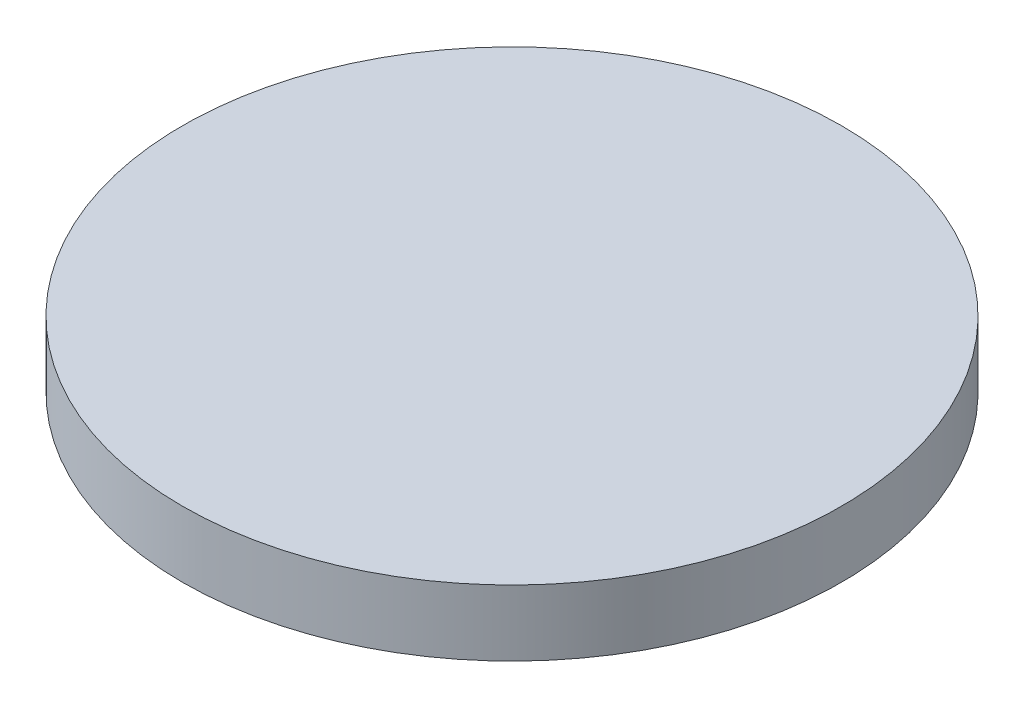
ISO-10303-21;
HEADER;
FILE_DESCRIPTION(('STEP AP214'),'2;1');
FILE_NAME('part.step','',(''),(''),'','','');
FILE_SCHEMA(('AUTOMOTIVE_DESIGN { 1 0 10303 214 1 1 1 1 }'));
ENDSEC;
DATA;
#1=APPLICATION_CONTEXT('core data for automotive mechanical design processes');
#2=APPLICATION_PROTOCOL_DEFINITION('international standard','automotive_design',2000,#1);
#3=PRODUCT_CONTEXT('',#1,'mechanical');
#4=PRODUCT('Part','Part','',(#3));
#5=PRODUCT_RELATED_PRODUCT_CATEGORY('part','',(#4));
#6=PRODUCT_DEFINITION_FORMATION('','',#4);
#7=PRODUCT_DEFINITION_CONTEXT('part definition',#1,'design');
#8=PRODUCT_DEFINITION('design','',#6,#7);
#9=PRODUCT_DEFINITION_SHAPE('','',#8);
#10=(LENGTH_UNIT() NAMED_UNIT(*) SI_UNIT(.MILLI.,.METRE.));
#11=(NAMED_UNIT(*) PLANE_ANGLE_UNIT() SI_UNIT($,.RADIAN.));
#12=(NAMED_UNIT(*) SI_UNIT($,.STERADIAN.) SOLID_ANGLE_UNIT());
#13=UNCERTAINTY_MEASURE_WITH_UNIT(LENGTH_MEASURE(1.E-05),#10,'distance_accuracy_value','');
#14=(GEOMETRIC_REPRESENTATION_CONTEXT(3) GLOBAL_UNCERTAINTY_ASSIGNED_CONTEXT((#13)) GLOBAL_UNIT_ASSIGNED_CONTEXT((#10,
#11,#12)) REPRESENTATION_CONTEXT('',''));
#15=CARTESIAN_POINT('',(0.,0.,0.));
#16=DIRECTION('',(0.,0.,1.));
#17=DIRECTION('',(1.,0.,0.));
#18=AXIS2_PLACEMENT_3D('',#15,#16,#17);
#19=CARTESIAN_POINT('',(0.,4.,0.));
#20=DIRECTION('',(0.,-1.,0.));
#21=DIRECTION('',(0.,0.,-1.));
#22=AXIS2_PLACEMENT_3D('',#19,#20,#21);
#23=CYLINDRICAL_SURFACE('',#22,40.);
#24=CARTESIAN_POINT('',(0.,4.,0.));
#25=DIRECTION('',(0.,1.,0.));
#26=DIRECTION('',(0.,0.,1.));
#27=AXIS2_PLACEMENT_3D('',#24,#25,#26);
#28=CIRCLE('',#27,40.);
#29=CARTESIAN_POINT('',(0.,4.,40.));
#30=VERTEX_POINT('',#29);
#31=EDGE_CURVE('E10',#30,#30,#28,.T.);
#32=ORIENTED_EDGE('',*,*,#31,.F.);
#33=EDGE_LOOP('',(#32));
#34=FACE_BOUND('',#33,.T.);
#35=CARTESIAN_POINT('',(0.,-4.,0.));
#36=DIRECTION('',(0.,1.,0.));
#37=DIRECTION('',(0.,0.,1.));
#38=AXIS2_PLACEMENT_3D('',#35,#36,#37);
#39=CIRCLE('',#38,40.);
#40=CARTESIAN_POINT('',(0.,-4.,40.));
#41=VERTEX_POINT('',#40);
#42=EDGE_CURVE('E33',#41,#41,#39,.T.);
#43=ORIENTED_EDGE('',*,*,#42,.T.);
#44=EDGE_LOOP('',(#43));
#45=FACE_BOUND('',#44,.T.);
#46=ADVANCED_FACE('F30',(#34,#45),#23,.T.);
#47=CARTESIAN_POINT('',(0.,4.,0.));
#48=DIRECTION('',(0.,1.,0.));
#49=DIRECTION('',(0.,0.,1.));
#50=AXIS2_PLACEMENT_3D('',#47,#48,#49);
#51=PLANE('',#50);
#52=ORIENTED_EDGE('',*,*,#31,.T.);
#53=EDGE_LOOP('',(#52));
#54=FACE_BOUND('',#53,.T.);
#55=ADVANCED_FACE('F45',(#54),#51,.T.);
#56=CARTESIAN_POINT('',(0.,-4.,0.));
#57=DIRECTION('',(0.,1.,0.));
#58=DIRECTION('',(0.,0.,1.));
#59=AXIS2_PLACEMENT_3D('',#56,#57,#58);
#60=PLANE('',#59);
#61=ORIENTED_EDGE('',*,*,#42,.F.);
#62=EDGE_LOOP('',(#61));
#63=FACE_BOUND('',#62,.T.);
#64=ADVANCED_FACE('F43',(#63),#60,.F.);
#65=CLOSED_SHELL('',(#46,#55,#64));
#66=MANIFOLD_SOLID_BREP('B2',#65);
#67=ADVANCED_BREP_SHAPE_REPRESENTATION('',(#18,#66),#14);
#68=SHAPE_DEFINITION_REPRESENTATION(#9,#67);
ENDSEC;
END-ISO-10303-21;
